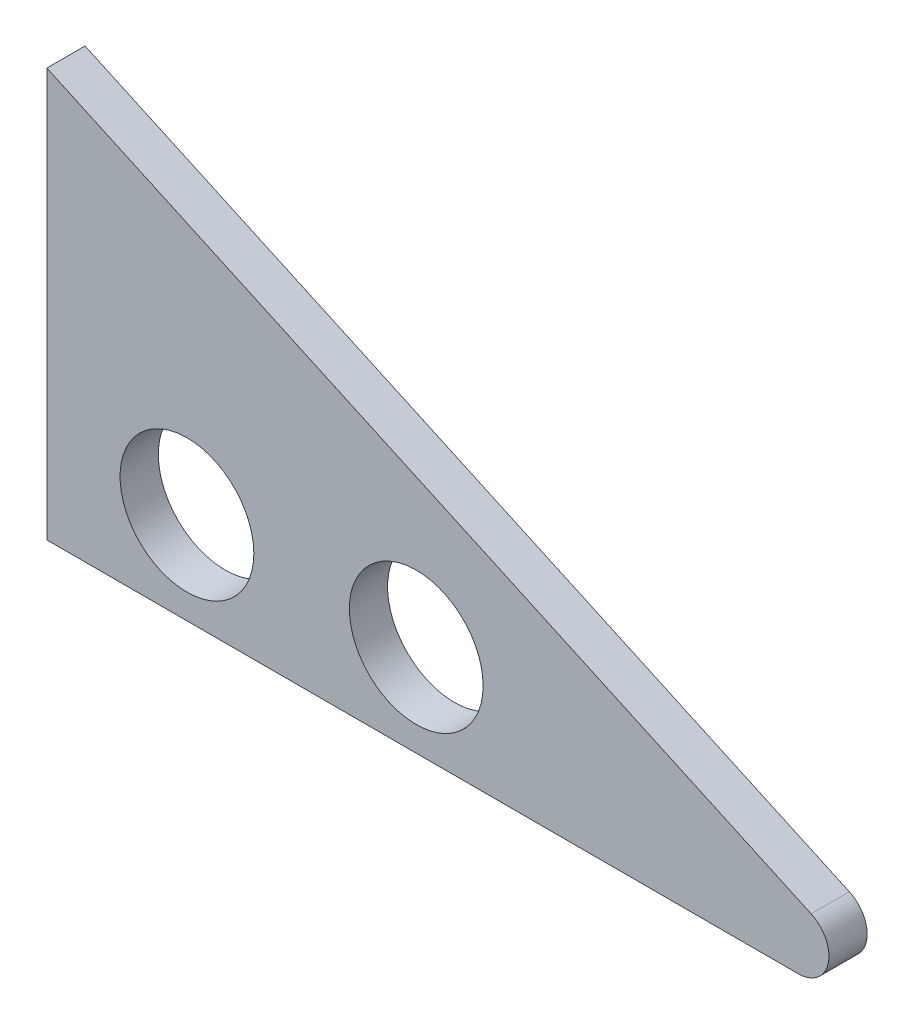
ISO-10303-21;
HEADER;
FILE_DESCRIPTION(('STEP AP214'),'2;1');
FILE_NAME('part.step','',(''),(''),'','','');
FILE_SCHEMA(('AUTOMOTIVE_DESIGN { 1 0 10303 214 1 1 1 1 }'));
ENDSEC;
DATA;
#1=APPLICATION_CONTEXT('core data for automotive mechanical design processes');
#2=APPLICATION_PROTOCOL_DEFINITION('international standard','automotive_design',2000,#1);
#3=PRODUCT_CONTEXT('',#1,'mechanical');
#4=PRODUCT('Part','Part','',(#3));
#5=PRODUCT_RELATED_PRODUCT_CATEGORY('part','',(#4));
#6=PRODUCT_DEFINITION_FORMATION('','',#4);
#7=PRODUCT_DEFINITION_CONTEXT('part definition',#1,'design');
#8=PRODUCT_DEFINITION('design','',#6,#7);
#9=PRODUCT_DEFINITION_SHAPE('','',#8);
#10=(LENGTH_UNIT() NAMED_UNIT(*) SI_UNIT(.MILLI.,.METRE.));
#11=(NAMED_UNIT(*) PLANE_ANGLE_UNIT() SI_UNIT($,.RADIAN.));
#12=(NAMED_UNIT(*) SI_UNIT($,.STERADIAN.) SOLID_ANGLE_UNIT());
#13=UNCERTAINTY_MEASURE_WITH_UNIT(LENGTH_MEASURE(1.E-05),#10,'distance_accuracy_value','');
#14=(GEOMETRIC_REPRESENTATION_CONTEXT(3) GLOBAL_UNCERTAINTY_ASSIGNED_CONTEXT((#13)) GLOBAL_UNIT_ASSIGNED_CONTEXT((#10,
#11,#12)) REPRESENTATION_CONTEXT('',''));
#15=CARTESIAN_POINT('',(0.,0.,0.));
#16=DIRECTION('',(0.,0.,1.));
#17=DIRECTION('',(1.,0.,0.));
#18=AXIS2_PLACEMENT_3D('',#15,#16,#17);
#19=CARTESIAN_POINT('',(152.62569751053,2.54,3.175));
#20=DIRECTION('',(0.,0.,1.));
#21=DIRECTION('',(1.,0.,0.));
#22=AXIS2_PLACEMENT_3D('',#19,#20,#21);
#23=PLANE('',#22);
#24=CARTESIAN_POINT('',(120.87569751053,7.62,3.175));
#25=DIRECTION('',(0.,0.,1.));
#26=DIRECTION('',(1.,0.,0.));
#27=AXIS2_PLACEMENT_3D('',#24,#25,#26);
#28=CIRCLE('',#27,5.55624999999998);
#29=CARTESIAN_POINT('',(126.43194751053,7.62,3.175));
#30=VERTEX_POINT('',#29);
#31=EDGE_CURVE('E99',#30,#30,#28,.T.);
#32=ORIENTED_EDGE('',*,*,#31,.F.);
#33=EDGE_LOOP('',(#32));
#34=FACE_BOUND('',#33,.T.);
#35=CARTESIAN_POINT('',(152.62569751053,2.54,3.175));
#36=DIRECTION('',(0.,0.,1.));
#37=DIRECTION('',(1.,0.,0.));
#38=AXIS2_PLACEMENT_3D('',#35,#36,#37);
#39=CIRCLE('',#38,2.54);
#40=CARTESIAN_POINT('',(152.62569751053,0.,3.175));
#41=VERTEX_POINT('',#40);
#42=CARTESIAN_POINT('',(153.684030843863,4.84901073093123,3.175));
#43=VERTEX_POINT('',#42);
#44=EDGE_CURVE('E84',#41,#43,#39,.T.);
#45=ORIENTED_EDGE('',*,*,#44,.T.);
#46=DIRECTION('',(-0.909059342886312,0.416666666666661,0.));
#47=VECTOR('',#46,1.);
#48=CARTESIAN_POINT('',(153.684030843863,4.84901073093123,3.175));
#49=LINE('',#48,#47);
#50=CARTESIAN_POINT('',(90.1840308438635,33.9541880115764,3.175));
#51=VERTEX_POINT('',#50);
#52=EDGE_CURVE('E79',#43,#51,#49,.T.);
#53=ORIENTED_EDGE('',*,*,#52,.T.);
#54=DIRECTION('',(0.,-1.,0.));
#55=VECTOR('',#54,1.);
#56=CARTESIAN_POINT('',(90.1840308438635,0.,3.175));
#57=LINE('',#56,#55);
#58=CARTESIAN_POINT('',(90.1840308438635,0.,3.175));
#59=VERTEX_POINT('',#58);
#60=EDGE_CURVE('E82',#51,#59,#57,.T.);
#61=ORIENTED_EDGE('',*,*,#60,.T.);
#62=DIRECTION('',(1.,0.,0.));
#63=VECTOR('',#62,1.);
#64=CARTESIAN_POINT('',(90.1840308438635,0.,3.175));
#65=LINE('',#64,#63);
#66=EDGE_CURVE('E49',#59,#41,#65,.T.);
#67=ORIENTED_EDGE('',*,*,#66,.T.);
#68=EDGE_LOOP('',(#45,#53,#61,#67));
#69=FACE_BOUND('',#68,.T.);
#70=CARTESIAN_POINT('',(101.82569751053,7.62,3.175));
#71=DIRECTION('',(0.,0.,1.));
#72=DIRECTION('',(1.,0.,0.));
#73=AXIS2_PLACEMENT_3D('',#70,#71,#72);
#74=CIRCLE('',#73,5.55625);
#75=CARTESIAN_POINT('',(107.38194751053,7.62,3.175));
#76=VERTEX_POINT('',#75);
#77=EDGE_CURVE('E114',#76,#76,#74,.T.);
#78=ORIENTED_EDGE('',*,*,#77,.F.);
#79=EDGE_LOOP('',(#78));
#80=FACE_BOUND('',#79,.T.);
#81=ADVANCED_FACE('F32',(#34,#69,#80),#23,.T.);
#82=CARTESIAN_POINT('',(152.62569751053,2.54,0.));
#83=DIRECTION('',(0.,0.,1.));
#84=DIRECTION('',(1.,0.,0.));
#85=AXIS2_PLACEMENT_3D('',#82,#83,#84);
#86=PLANE('',#85);
#87=CARTESIAN_POINT('',(120.87569751053,7.62,0.));
#88=DIRECTION('',(0.,0.,1.));
#89=DIRECTION('',(1.,0.,0.));
#90=AXIS2_PLACEMENT_3D('',#87,#88,#89);
#91=CIRCLE('',#90,5.55624999999998);
#92=CARTESIAN_POINT('',(126.43194751053,7.62,0.));
#93=VERTEX_POINT('',#92);
#94=EDGE_CURVE('E111',#93,#93,#91,.T.);
#95=ORIENTED_EDGE('',*,*,#94,.T.);
#96=EDGE_LOOP('',(#95));
#97=FACE_BOUND('',#96,.T.);
#98=CARTESIAN_POINT('',(152.62569751053,2.54,0.));
#99=DIRECTION('',(0.,0.,1.));
#100=DIRECTION('',(1.,0.,0.));
#101=AXIS2_PLACEMENT_3D('',#98,#99,#100);
#102=CIRCLE('',#101,2.54);
#103=CARTESIAN_POINT('',(152.62569751053,0.,0.));
#104=VERTEX_POINT('',#103);
#105=CARTESIAN_POINT('',(153.684030843863,4.84901073093123,0.));
#106=VERTEX_POINT('',#105);
#107=EDGE_CURVE('E96',#104,#106,#102,.T.);
#108=ORIENTED_EDGE('',*,*,#107,.F.);
#109=DIRECTION('',(1.,0.,0.));
#110=VECTOR('',#109,1.);
#111=CARTESIAN_POINT('',(90.1840308438635,0.,0.));
#112=LINE('',#111,#110);
#113=CARTESIAN_POINT('',(90.1840308438635,0.,0.));
#114=VERTEX_POINT('',#113);
#115=EDGE_CURVE('E72',#114,#104,#112,.T.);
#116=ORIENTED_EDGE('',*,*,#115,.F.);
#117=DIRECTION('',(0.,-1.,0.));
#118=VECTOR('',#117,1.);
#119=CARTESIAN_POINT('',(90.1840308438635,0.,0.));
#120=LINE('',#119,#118);
#121=CARTESIAN_POINT('',(90.1840308438635,33.9541880115764,0.));
#122=VERTEX_POINT('',#121);
#123=EDGE_CURVE('E66',#122,#114,#120,.T.);
#124=ORIENTED_EDGE('',*,*,#123,.F.);
#125=DIRECTION('',(-0.909059342886312,0.416666666666661,0.));
#126=VECTOR('',#125,1.);
#127=CARTESIAN_POINT('',(153.684030843863,4.84901073093123,0.));
#128=LINE('',#127,#126);
#129=EDGE_CURVE('E88',#106,#122,#128,.T.);
#130=ORIENTED_EDGE('',*,*,#129,.F.);
#131=EDGE_LOOP('',(#108,#116,#124,#130));
#132=FACE_BOUND('',#131,.T.);
#133=CARTESIAN_POINT('',(101.82569751053,7.62,0.));
#134=DIRECTION('',(0.,0.,1.));
#135=DIRECTION('',(1.,0.,0.));
#136=AXIS2_PLACEMENT_3D('',#133,#134,#135);
#137=CIRCLE('',#136,5.55625);
#138=CARTESIAN_POINT('',(107.38194751053,7.62,0.));
#139=VERTEX_POINT('',#138);
#140=EDGE_CURVE('E117',#139,#139,#137,.T.);
#141=ORIENTED_EDGE('',*,*,#140,.T.);
#142=EDGE_LOOP('',(#141));
#143=FACE_BOUND('',#142,.T.);
#144=ADVANCED_FACE('F107',(#97,#132,#143),#86,.F.);
#145=CARTESIAN_POINT('',(152.62569751053,2.54,3.175));
#146=DIRECTION('',(0.,0.,-1.));
#147=DIRECTION('',(-1.,0.,0.));
#148=AXIS2_PLACEMENT_3D('',#145,#146,#147);
#149=CYLINDRICAL_SURFACE('',#148,2.54);
#150=ORIENTED_EDGE('',*,*,#107,.T.);
#151=DIRECTION('',(0.,0.,-1.));
#152=VECTOR('',#151,1.);
#153=CARTESIAN_POINT('',(153.684030843863,4.84901073093123,3.175));
#154=LINE('',#153,#152);
#155=EDGE_CURVE('E11',#43,#106,#154,.T.);
#156=ORIENTED_EDGE('',*,*,#155,.F.);
#157=ORIENTED_EDGE('',*,*,#44,.F.);
#158=DIRECTION('',(0.,0.,-1.));
#159=VECTOR('',#158,1.);
#160=CARTESIAN_POINT('',(152.62569751053,0.,3.175));
#161=LINE('',#160,#159);
#162=EDGE_CURVE('E92',#41,#104,#161,.T.);
#163=ORIENTED_EDGE('',*,*,#162,.T.);
#164=EDGE_LOOP('',(#150,#156,#157,#163));
#165=FACE_BOUND('',#164,.T.);
#166=ADVANCED_FACE('F34',(#165),#149,.T.);
#167=CARTESIAN_POINT('',(153.684030843863,4.84901073093123,3.175));
#168=DIRECTION('',(-0.416666666666661,-0.909059342886312,0.));
#169=DIRECTION('',(0.909059342886312,-0.416666666666661,0.));
#170=AXIS2_PLACEMENT_3D('',#167,#168,#169);
#171=PLANE('',#170);
#172=ORIENTED_EDGE('',*,*,#129,.T.);
#173=DIRECTION('',(0.,0.,-1.));
#174=VECTOR('',#173,1.);
#175=CARTESIAN_POINT('',(90.1840308438635,33.9541880115764,3.175));
#176=LINE('',#175,#174);
#177=EDGE_CURVE('E41',#51,#122,#176,.T.);
#178=ORIENTED_EDGE('',*,*,#177,.F.);
#179=ORIENTED_EDGE('',*,*,#52,.F.);
#180=ORIENTED_EDGE('',*,*,#155,.T.);
#181=EDGE_LOOP('',(#172,#178,#179,#180));
#182=FACE_BOUND('',#181,.T.);
#183=ADVANCED_FACE('F87',(#182),#171,.F.);
#184=CARTESIAN_POINT('',(90.1840308438635,0.,3.175));
#185=DIRECTION('',(1.,0.,0.));
#186=DIRECTION('',(0.,0.,-1.));
#187=AXIS2_PLACEMENT_3D('',#184,#185,#186);
#188=PLANE('',#187);
#189=ORIENTED_EDGE('',*,*,#123,.T.);
#190=DIRECTION('',(0.,0.,-1.));
#191=VECTOR('',#190,1.);
#192=CARTESIAN_POINT('',(90.1840308438635,0.,3.175));
#193=LINE('',#192,#191);
#194=EDGE_CURVE('E89',#59,#114,#193,.T.);
#195=ORIENTED_EDGE('',*,*,#194,.F.);
#196=ORIENTED_EDGE('',*,*,#60,.F.);
#197=ORIENTED_EDGE('',*,*,#177,.T.);
#198=EDGE_LOOP('',(#189,#195,#196,#197));
#199=FACE_BOUND('',#198,.T.);
#200=ADVANCED_FACE('F90',(#199),#188,.F.);
#201=CARTESIAN_POINT('',(90.1840308438635,0.,3.175));
#202=DIRECTION('',(0.,1.,0.));
#203=DIRECTION('',(0.,0.,1.));
#204=AXIS2_PLACEMENT_3D('',#201,#202,#203);
#205=PLANE('',#204);
#206=ORIENTED_EDGE('',*,*,#115,.T.);
#207=ORIENTED_EDGE('',*,*,#162,.F.);
#208=ORIENTED_EDGE('',*,*,#66,.F.);
#209=ORIENTED_EDGE('',*,*,#194,.T.);
#210=EDGE_LOOP('',(#206,#207,#208,#209));
#211=FACE_BOUND('',#210,.T.);
#212=ADVANCED_FACE('F104',(#211),#205,.F.);
#213=CARTESIAN_POINT('',(120.87569751053,7.62,3.175));
#214=DIRECTION('',(0.,0.,-1.));
#215=DIRECTION('',(-1.,0.,0.));
#216=AXIS2_PLACEMENT_3D('',#213,#214,#215);
#217=CYLINDRICAL_SURFACE('',#216,5.55624999999998);
#218=ORIENTED_EDGE('',*,*,#31,.T.);
#219=EDGE_LOOP('',(#218));
#220=FACE_BOUND('',#219,.T.);
#221=ORIENTED_EDGE('',*,*,#94,.F.);
#222=EDGE_LOOP('',(#221));
#223=FACE_BOUND('',#222,.T.);
#224=ADVANCED_FACE('F135',(#220,#223),#217,.F.);
#225=CARTESIAN_POINT('',(101.82569751053,7.62,3.175));
#226=DIRECTION('',(0.,0.,-1.));
#227=DIRECTION('',(-1.,0.,0.));
#228=AXIS2_PLACEMENT_3D('',#225,#226,#227);
#229=CYLINDRICAL_SURFACE('',#228,5.55625);
#230=ORIENTED_EDGE('',*,*,#77,.T.);
#231=EDGE_LOOP('',(#230));
#232=FACE_BOUND('',#231,.T.);
#233=ORIENTED_EDGE('',*,*,#140,.F.);
#234=EDGE_LOOP('',(#233));
#235=FACE_BOUND('',#234,.T.);
#236=ADVANCED_FACE('F123',(#232,#235),#229,.F.);
#237=CLOSED_SHELL('',(#81,#144,#166,#183,#200,#212,#224,#236));
#238=MANIFOLD_SOLID_BREP('B2',#237);
#239=ADVANCED_BREP_SHAPE_REPRESENTATION('',(#18,#238),#14);
#240=SHAPE_DEFINITION_REPRESENTATION(#9,#239);
ENDSEC;
END-ISO-10303-21;
